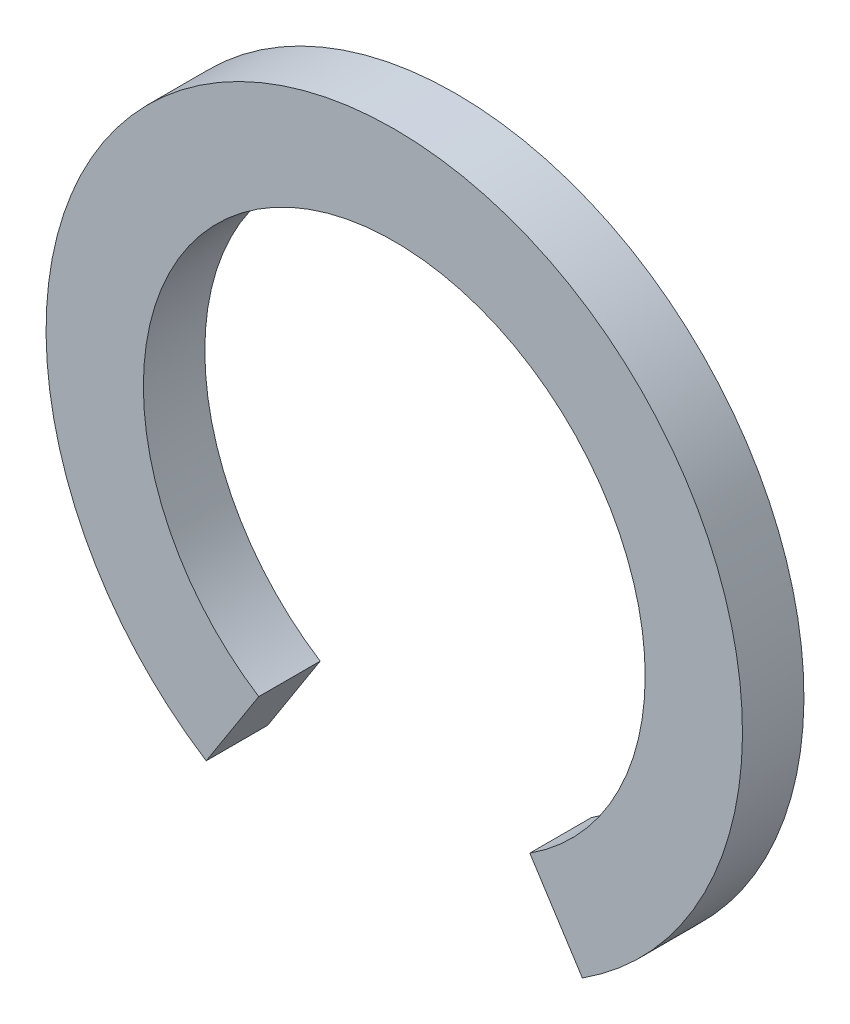
ISO-10303-21;
HEADER;
FILE_DESCRIPTION(('STEP AP214'),'2;1');
FILE_NAME('part.step','',(''),(''),'','','');
FILE_SCHEMA(('AUTOMOTIVE_DESIGN { 1 0 10303 214 1 1 1 1 }'));
ENDSEC;
DATA;
#1=APPLICATION_CONTEXT('core data for automotive mechanical design processes');
#2=APPLICATION_PROTOCOL_DEFINITION('international standard','automotive_design',2000,#1);
#3=PRODUCT_CONTEXT('',#1,'mechanical');
#4=PRODUCT('Part','Part','',(#3));
#5=PRODUCT_RELATED_PRODUCT_CATEGORY('part','',(#4));
#6=PRODUCT_DEFINITION_FORMATION('','',#4);
#7=PRODUCT_DEFINITION_CONTEXT('part definition',#1,'design');
#8=PRODUCT_DEFINITION('design','',#6,#7);
#9=PRODUCT_DEFINITION_SHAPE('','',#8);
#10=(LENGTH_UNIT() NAMED_UNIT(*) SI_UNIT(.MILLI.,.METRE.));
#11=(NAMED_UNIT(*) PLANE_ANGLE_UNIT() SI_UNIT($,.RADIAN.));
#12=(NAMED_UNIT(*) SI_UNIT($,.STERADIAN.) SOLID_ANGLE_UNIT());
#13=UNCERTAINTY_MEASURE_WITH_UNIT(LENGTH_MEASURE(1.E-05),#10,'distance_accuracy_value','');
#14=(GEOMETRIC_REPRESENTATION_CONTEXT(3) GLOBAL_UNCERTAINTY_ASSIGNED_CONTEXT((#13)) GLOBAL_UNIT_ASSIGNED_CONTEXT((#10,
#11,#12)) REPRESENTATION_CONTEXT('',''));
#15=CARTESIAN_POINT('',(0.,0.,0.));
#16=DIRECTION('',(0.,0.,1.));
#17=DIRECTION('',(1.,0.,0.));
#18=AXIS2_PLACEMENT_3D('',#15,#16,#17);
#19=CARTESIAN_POINT('',(0.,0.,1.5));
#20=DIRECTION('',(0.,0.,-1.));
#21=DIRECTION('',(-1.,0.,0.));
#22=AXIS2_PLACEMENT_3D('',#19,#20,#21);
#23=CYLINDRICAL_SURFACE('',#22,6.125);
#24=CARTESIAN_POINT('',(0.,0.,0.));
#25=DIRECTION('',(0.,0.,-1.));
#26=DIRECTION('',(1.,0.,0.));
#27=AXIS2_PLACEMENT_3D('',#24,#25,#26);
#28=CIRCLE('',#27,6.125);
#29=CARTESIAN_POINT('',(-3.30825332971792,-5.15471482299558,0.));
#30=VERTEX_POINT('',#29);
#31=CARTESIAN_POINT('',(3.30825332971792,-5.15471482299558,0.));
#32=VERTEX_POINT('',#31);
#33=EDGE_CURVE('E107',#30,#32,#28,.T.);
#34=ORIENTED_EDGE('',*,*,#33,.T.);
#35=DIRECTION('',(0.,0.,-1.));
#36=VECTOR('',#35,1.);
#37=CARTESIAN_POINT('',(3.30825332971792,-5.15471482299558,1.5));
#38=LINE('',#37,#36);
#39=CARTESIAN_POINT('',(3.30825332971792,-5.15471482299558,1.5));
#40=VERTEX_POINT('',#39);
#41=EDGE_CURVE('E11',#40,#32,#38,.T.);
#42=ORIENTED_EDGE('',*,*,#41,.F.);
#43=CARTESIAN_POINT('',(0.,0.,1.5));
#44=DIRECTION('',(0.,0.,-1.));
#45=DIRECTION('',(1.,0.,0.));
#46=AXIS2_PLACEMENT_3D('',#43,#44,#45);
#47=CIRCLE('',#46,6.125);
#48=CARTESIAN_POINT('',(-3.30825332971792,-5.15471482299558,1.5));
#49=VERTEX_POINT('',#48);
#50=EDGE_CURVE('E91',#49,#40,#47,.T.);
#51=ORIENTED_EDGE('',*,*,#50,.F.);
#52=DIRECTION('',(0.,0.,-1.));
#53=VECTOR('',#52,1.);
#54=CARTESIAN_POINT('',(-3.30825332971792,-5.15471482299558,1.5));
#55=LINE('',#54,#53);
#56=EDGE_CURVE('E103',#49,#30,#55,.T.);
#57=ORIENTED_EDGE('',*,*,#56,.T.);
#58=EDGE_LOOP('',(#34,#42,#51,#57));
#59=FACE_BOUND('',#58,.T.);
#60=ADVANCED_FACE('F39',(#59),#23,.F.);
#61=CARTESIAN_POINT('',(3.30825332971792,-5.15471482299558,1.5));
#62=DIRECTION('',(0.841586093550298,0.540122992607007,0.));
#63=DIRECTION('',(-0.540122992607007,0.841586093550298,0.));
#64=AXIS2_PLACEMENT_3D('',#61,#62,#63);
#65=PLANE('',#64);
#66=DIRECTION('',(0.540122992607007,-0.841586093550298,0.));
#67=VECTOR('',#66,1.);
#68=CARTESIAN_POINT('',(3.30825332971792,-5.15471482299558,0.));
#69=LINE('',#68,#67);
#70=CARTESIAN_POINT('',(4.59104543715956,-7.15348179517753,0.));
#71=VERTEX_POINT('',#70);
#72=EDGE_CURVE('E96',#32,#71,#69,.T.);
#73=ORIENTED_EDGE('',*,*,#72,.T.);
#74=DIRECTION('',(0.,0.,-1.));
#75=VECTOR('',#74,1.);
#76=CARTESIAN_POINT('',(4.59104543715956,-7.15348179517753,1.5));
#77=LINE('',#76,#75);
#78=CARTESIAN_POINT('',(4.59104543715956,-7.15348179517753,1.5));
#79=VERTEX_POINT('',#78);
#80=EDGE_CURVE('E48',#79,#71,#77,.T.);
#81=ORIENTED_EDGE('',*,*,#80,.F.);
#82=DIRECTION('',(0.540122992607007,-0.841586093550298,0.));
#83=VECTOR('',#82,1.);
#84=CARTESIAN_POINT('',(3.30825332971792,-5.15471482299558,1.5));
#85=LINE('',#84,#83);
#86=EDGE_CURVE('E86',#40,#79,#85,.T.);
#87=ORIENTED_EDGE('',*,*,#86,.F.);
#88=ORIENTED_EDGE('',*,*,#41,.T.);
#89=EDGE_LOOP('',(#73,#81,#87,#88));
#90=FACE_BOUND('',#89,.T.);
#91=ADVANCED_FACE('F95',(#90),#65,.F.);
#92=CARTESIAN_POINT('',(0.,0.,1.5));
#93=DIRECTION('',(0.,0.,-1.));
#94=DIRECTION('',(-1.,0.,0.));
#95=AXIS2_PLACEMENT_3D('',#92,#93,#94);
#96=CYLINDRICAL_SURFACE('',#95,8.5);
#97=CARTESIAN_POINT('',(0.,0.,0.));
#98=DIRECTION('',(0.,0.,1.));
#99=DIRECTION('',(1.,0.,0.));
#100=AXIS2_PLACEMENT_3D('',#97,#98,#99);
#101=CIRCLE('',#100,8.5);
#102=CARTESIAN_POINT('',(-4.59104543715956,-7.15348179517753,0.));
#103=VERTEX_POINT('',#102);
#104=EDGE_CURVE('E73',#71,#103,#101,.T.);
#105=ORIENTED_EDGE('',*,*,#104,.T.);
#106=DIRECTION('',(0.,0.,-1.));
#107=VECTOR('',#106,1.);
#108=CARTESIAN_POINT('',(-4.59104543715956,-7.15348179517753,1.5));
#109=LINE('',#108,#107);
#110=CARTESIAN_POINT('',(-4.59104543715956,-7.15348179517753,1.5));
#111=VERTEX_POINT('',#110);
#112=EDGE_CURVE('E98',#111,#103,#109,.T.);
#113=ORIENTED_EDGE('',*,*,#112,.F.);
#114=CARTESIAN_POINT('',(0.,0.,1.5));
#115=DIRECTION('',(0.,0.,1.));
#116=DIRECTION('',(1.,0.,0.));
#117=AXIS2_PLACEMENT_3D('',#114,#115,#116);
#118=CIRCLE('',#117,8.5);
#119=EDGE_CURVE('E89',#79,#111,#118,.T.);
#120=ORIENTED_EDGE('',*,*,#119,.F.);
#121=ORIENTED_EDGE('',*,*,#80,.T.);
#122=EDGE_LOOP('',(#105,#113,#120,#121));
#123=FACE_BOUND('',#122,.T.);
#124=ADVANCED_FACE('F99',(#123),#96,.T.);
#125=CARTESIAN_POINT('',(-3.30825332971792,-5.15471482299558,1.5));
#126=DIRECTION('',(-0.841586093550298,0.540122992607007,0.));
#127=DIRECTION('',(-0.540122992607007,-0.841586093550298,0.));
#128=AXIS2_PLACEMENT_3D('',#125,#126,#127);
#129=PLANE('',#128);
#130=DIRECTION('',(0.540122992607007,0.841586093550298,0.));
#131=VECTOR('',#130,1.);
#132=CARTESIAN_POINT('',(-3.30825332971792,-5.15471482299558,0.));
#133=LINE('',#132,#131);
#134=EDGE_CURVE('E79',#103,#30,#133,.T.);
#135=ORIENTED_EDGE('',*,*,#134,.T.);
#136=ORIENTED_EDGE('',*,*,#56,.F.);
#137=DIRECTION('',(0.540122992607007,0.841586093550298,0.));
#138=VECTOR('',#137,1.);
#139=CARTESIAN_POINT('',(-3.30825332971792,-5.15471482299558,1.5));
#140=LINE('',#139,#138);
#141=EDGE_CURVE('E56',#111,#49,#140,.T.);
#142=ORIENTED_EDGE('',*,*,#141,.F.);
#143=ORIENTED_EDGE('',*,*,#112,.T.);
#144=EDGE_LOOP('',(#135,#136,#142,#143));
#145=FACE_BOUND('',#144,.T.);
#146=ADVANCED_FACE('F120',(#145),#129,.F.);
#147=CARTESIAN_POINT('',(0.,0.,1.5));
#148=DIRECTION('',(0.,0.,1.));
#149=DIRECTION('',(1.,0.,0.));
#150=AXIS2_PLACEMENT_3D('',#147,#148,#149);
#151=PLANE('',#150);
#152=ORIENTED_EDGE('',*,*,#50,.T.);
#153=ORIENTED_EDGE('',*,*,#86,.T.);
#154=ORIENTED_EDGE('',*,*,#119,.T.);
#155=ORIENTED_EDGE('',*,*,#141,.T.);
#156=EDGE_LOOP('',(#152,#153,#154,#155));
#157=FACE_BOUND('',#156,.T.);
#158=ADVANCED_FACE('F87',(#157),#151,.T.);
#159=CARTESIAN_POINT('',(0.,0.,0.));
#160=DIRECTION('',(0.,0.,1.));
#161=DIRECTION('',(1.,0.,0.));
#162=AXIS2_PLACEMENT_3D('',#159,#160,#161);
#163=PLANE('',#162);
#164=ORIENTED_EDGE('',*,*,#33,.F.);
#165=ORIENTED_EDGE('',*,*,#134,.F.);
#166=ORIENTED_EDGE('',*,*,#104,.F.);
#167=ORIENTED_EDGE('',*,*,#72,.F.);
#168=EDGE_LOOP('',(#164,#165,#166,#167));
#169=FACE_BOUND('',#168,.T.);
#170=ADVANCED_FACE('F123',(#169),#163,.F.);
#171=CLOSED_SHELL('',(#60,#91,#124,#146,#158,#170));
#172=MANIFOLD_SOLID_BREP('B2',#171);
#173=ADVANCED_BREP_SHAPE_REPRESENTATION('',(#18,#172),#14);
#174=SHAPE_DEFINITION_REPRESENTATION(#9,#173);
ENDSEC;
END-ISO-10303-21;
